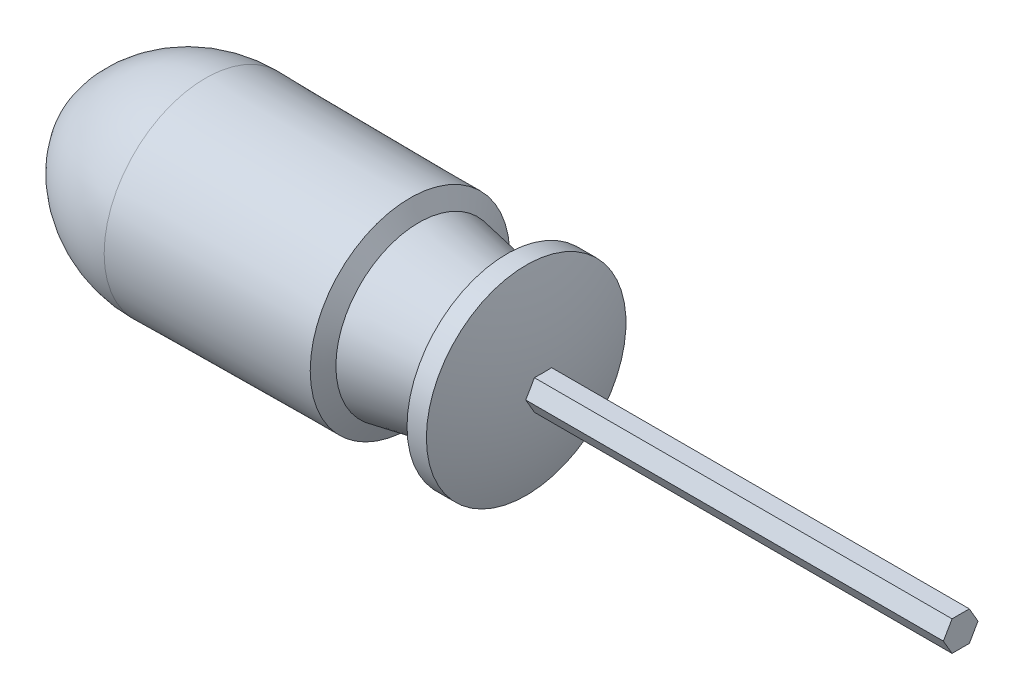
ISO-10303-21;
HEADER;
FILE_DESCRIPTION(('STEP AP214'),'2;1');
FILE_NAME('part.step','',(''),(''),'','','');
FILE_SCHEMA(('AUTOMOTIVE_DESIGN { 1 0 10303 214 1 1 1 1 }'));
ENDSEC;
DATA;
#1=APPLICATION_CONTEXT('core data for automotive mechanical design processes');
#2=APPLICATION_PROTOCOL_DEFINITION('international standard','automotive_design',2000,#1);
#3=PRODUCT_CONTEXT('',#1,'mechanical');
#4=PRODUCT('Part','Part','',(#3));
#5=PRODUCT_RELATED_PRODUCT_CATEGORY('part','',(#4));
#6=PRODUCT_DEFINITION_FORMATION('','',#4);
#7=PRODUCT_DEFINITION_CONTEXT('part definition',#1,'design');
#8=PRODUCT_DEFINITION('design','',#6,#7);
#9=PRODUCT_DEFINITION_SHAPE('','',#8);
#10=(LENGTH_UNIT() NAMED_UNIT(*) SI_UNIT(.MILLI.,.METRE.));
#11=(NAMED_UNIT(*) PLANE_ANGLE_UNIT() SI_UNIT($,.RADIAN.));
#12=(NAMED_UNIT(*) SI_UNIT($,.STERADIAN.) SOLID_ANGLE_UNIT());
#13=UNCERTAINTY_MEASURE_WITH_UNIT(LENGTH_MEASURE(1.E-05),#10,'distance_accuracy_value','');
#14=(GEOMETRIC_REPRESENTATION_CONTEXT(3) GLOBAL_UNCERTAINTY_ASSIGNED_CONTEXT((#13)) GLOBAL_UNIT_ASSIGNED_CONTEXT((#10,
#11,#12)) REPRESENTATION_CONTEXT('',''));
#15=CARTESIAN_POINT('',(0.,0.,0.));
#16=DIRECTION('',(0.,0.,1.));
#17=DIRECTION('',(1.,0.,0.));
#18=AXIS2_PLACEMENT_3D('',#15,#16,#17);
#19=CARTESIAN_POINT('',(-24.682464408379,0.,0.));
#20=DIRECTION('',(-1.,0.,0.));
#21=DIRECTION('',(0.,1.,0.));
#22=AXIS2_PLACEMENT_3D('',#19,#20,#21);
#23=SPHERICAL_SURFACE('',#22,64.1850623551619);
#24=CARTESIAN_POINT('',(35.7416775098517,0.,0.));
#25=DIRECTION('',(-1.,0.,0.));
#26=DIRECTION('',(0.,0.,1.));
#27=AXIS2_PLACEMENT_3D('',#24,#25,#26);
#28=CIRCLE('',#27,21.6482170855138);
#29=CARTESIAN_POINT('',(35.7416775098517,0.,21.6482170855138));
#30=VERTEX_POINT('',#29);
#31=EDGE_CURVE('E108',#30,#30,#28,.T.);
#32=ORIENTED_EDGE('',*,*,#31,.F.);
#33=EDGE_LOOP('',(#32));
#34=FACE_BOUND('',#33,.T.);
#35=CARTESIAN_POINT('',(-24.682464408379,-1.625,-2.81458256229942));
#36=DIRECTION('',(0.,0.5,0.866025403784438));
#37=DIRECTION('',(0.,-0.866025403784439,0.5));
#38=AXIS2_PLACEMENT_3D('',#35,#36,#37);
#39=CIRCLE('',#38,64.1027279414537);
#40=CARTESIAN_POINT('',(39.3927952181156,-3.25,-1.87638837486628));
#41=VERTEX_POINT('',#40);
#42=CARTESIAN_POINT('',(39.3927952181156,0.,-3.75277674973256));
#43=VERTEX_POINT('',#42);
#44=EDGE_CURVE('E11',#41,#43,#39,.T.);
#45=ORIENTED_EDGE('',*,*,#44,.F.);
#46=CARTESIAN_POINT('',(-24.682464408379,-3.25,0.));
#47=DIRECTION('',(0.,1.,0.));
#48=DIRECTION('',(0.,0.,1.));
#49=AXIS2_PLACEMENT_3D('',#46,#47,#48);
#50=CIRCLE('',#49,64.1027279414537);
#51=CARTESIAN_POINT('',(39.3927952181156,-3.25,1.87638837486629));
#52=VERTEX_POINT('',#51);
#53=EDGE_CURVE('E134',#52,#41,#50,.T.);
#54=ORIENTED_EDGE('',*,*,#53,.F.);
#55=CARTESIAN_POINT('',(-24.682464408379,-1.625,2.81458256229943));
#56=DIRECTION('',(0.,0.5,-0.866025403784439));
#57=DIRECTION('',(0.,0.866025403784439,0.5));
#58=AXIS2_PLACEMENT_3D('',#55,#56,#57);
#59=CIRCLE('',#58,64.1027279414537);
#60=CARTESIAN_POINT('',(39.3927952181156,0.,3.75277674973257));
#61=VERTEX_POINT('',#60);
#62=EDGE_CURVE('E137',#61,#52,#59,.T.);
#63=ORIENTED_EDGE('',*,*,#62,.F.);
#64=CARTESIAN_POINT('',(-24.682464408379,1.625,2.81458256229942));
#65=DIRECTION('',(0.,-0.5,-0.866025403784438));
#66=DIRECTION('',(0.,0.866025403784438,-0.5));
#67=AXIS2_PLACEMENT_3D('',#64,#65,#66);
#68=CIRCLE('',#67,64.1027279414537);
#69=CARTESIAN_POINT('',(39.3927952181156,3.25,1.87638837486628));
#70=VERTEX_POINT('',#69);
#71=EDGE_CURVE('E140',#70,#61,#68,.T.);
#72=ORIENTED_EDGE('',*,*,#71,.F.);
#73=CARTESIAN_POINT('',(-24.682464408379,3.25,0.));
#74=DIRECTION('',(0.,-1.,0.));
#75=DIRECTION('',(0.,0.,-1.));
#76=AXIS2_PLACEMENT_3D('',#73,#74,#75);
#77=CIRCLE('',#76,64.1027279414537);
#78=CARTESIAN_POINT('',(39.3927952181156,3.25,-1.87638837486628));
#79=VERTEX_POINT('',#78);
#80=EDGE_CURVE('E53',#79,#70,#77,.T.);
#81=ORIENTED_EDGE('',*,*,#80,.F.);
#82=CARTESIAN_POINT('',(-24.682464408379,1.625,-2.81458256229942));
#83=DIRECTION('',(0.,-0.5,0.866025403784439));
#84=DIRECTION('',(0.,-0.866025403784439,-0.5));
#85=AXIS2_PLACEMENT_3D('',#82,#83,#84);
#86=CIRCLE('',#85,64.1027279414537);
#87=EDGE_CURVE('E43',#43,#79,#86,.T.);
#88=ORIENTED_EDGE('',*,*,#87,.F.);
#89=EDGE_LOOP('',(#45,#54,#63,#72,#81,#88));
#90=FACE_BOUND('',#89,.T.);
#91=ADVANCED_FACE('F35',(#34,#90),#23,.T.);
#92=CARTESIAN_POINT('',(-90.0820529367058,0.,0.));
#93=DIRECTION('',(-1.,0.,0.));
#94=DIRECTION('',(0.,0.,1.));
#95=AXIS2_PLACEMENT_3D('',#92,#93,#94);
#96=CYLINDRICAL_SURFACE('',#95,21.6482170855138);
#97=CARTESIAN_POINT('',(31.5416775098517,0.,0.));
#98=DIRECTION('',(-1.,0.,0.));
#99=DIRECTION('',(0.,0.,1.));
#100=AXIS2_PLACEMENT_3D('',#97,#98,#99);
#101=CIRCLE('',#100,21.6482170855138);
#102=CARTESIAN_POINT('',(31.5416775098517,0.,21.6482170855138));
#103=VERTEX_POINT('',#102);
#104=EDGE_CURVE('E131',#103,#103,#101,.T.);
#105=ORIENTED_EDGE('',*,*,#104,.F.);
#106=EDGE_LOOP('',(#105));
#107=FACE_BOUND('',#106,.T.);
#108=ORIENTED_EDGE('',*,*,#31,.T.);
#109=EDGE_LOOP('',(#108));
#110=FACE_BOUND('',#109,.T.);
#111=ADVANCED_FACE('F37',(#107,#110),#96,.T.);
#112=CARTESIAN_POINT('',(17.3280453235944,0.,0.));
#113=DIRECTION('',(-1.,0.,0.));
#114=DIRECTION('',(0.,0.,1.));
#115=AXIS2_PLACEMENT_3D('',#112,#113,#114);
#116=TOROIDAL_SURFACE('',#115,21.6482170855138,14.2136321862573);
#117=CARTESIAN_POINT('',(29.7831351536954,0.,0.));
#118=DIRECTION('',(-1.,0.,0.));
#119=DIRECTION('',(0.,0.,1.));
#120=AXIS2_PLACEMENT_3D('',#117,#118,#119);
#121=CIRCLE('',#120,14.8);
#122=CARTESIAN_POINT('',(29.7831351536954,0.,14.8));
#123=VERTEX_POINT('',#122);
#124=EDGE_CURVE('E128',#123,#123,#121,.T.);
#125=ORIENTED_EDGE('',*,*,#124,.F.);
#126=EDGE_LOOP('',(#125));
#127=FACE_BOUND('',#126,.T.);
#128=ORIENTED_EDGE('',*,*,#104,.T.);
#129=EDGE_LOOP('',(#128));
#130=FACE_BOUND('',#129,.T.);
#131=ADVANCED_FACE('F177',(#127,#130),#116,.F.);
#132=CARTESIAN_POINT('',(29.7831351536954,0.,0.));
#133=DIRECTION('',(-1.,0.,0.));
#134=DIRECTION('',(0.,0.,1.));
#135=AXIS2_PLACEMENT_3D('',#132,#133,#134);
#136=CONICAL_SURFACE('',#135,14.8,0.182701239732058);
#137=CARTESIAN_POINT('',(12.4635183837141,0.,0.));
#138=DIRECTION('',(-1.,0.,0.));
#139=DIRECTION('',(0.,0.,1.));
#140=AXIS2_PLACEMENT_3D('',#137,#138,#139);
#141=CIRCLE('',#140,18.);
#142=CARTESIAN_POINT('',(12.4635183837141,0.,18.));
#143=VERTEX_POINT('',#142);
#144=EDGE_CURVE('E125',#143,#143,#141,.T.);
#145=ORIENTED_EDGE('',*,*,#144,.F.);
#146=EDGE_LOOP('',(#145));
#147=FACE_BOUND('',#146,.T.);
#148=ORIENTED_EDGE('',*,*,#124,.T.);
#149=EDGE_LOOP('',(#148));
#150=FACE_BOUND('',#149,.T.);
#151=ADVANCED_FACE('F198',(#147,#150),#136,.T.);
#152=CARTESIAN_POINT('',(12.4635183837141,0.,0.));
#153=DIRECTION('',(-1.,0.,0.));
#154=DIRECTION('',(0.,0.,1.));
#155=AXIS2_PLACEMENT_3D('',#152,#153,#154);
#156=CONICAL_SURFACE('',#155,18.,1.08594785594218);
#157=CARTESIAN_POINT('',(10.5416775098517,0.,0.));
#158=DIRECTION('',(-1.,0.,0.));
#159=DIRECTION('',(0.,0.,1.));
#160=AXIS2_PLACEMENT_3D('',#157,#158,#159);
#161=CIRCLE('',#160,21.6482170855138);
#162=CARTESIAN_POINT('',(10.5416775098517,0.,21.6482170855138));
#163=VERTEX_POINT('',#162);
#164=EDGE_CURVE('E122',#163,#163,#161,.T.);
#165=ORIENTED_EDGE('',*,*,#164,.F.);
#166=EDGE_LOOP('',(#165));
#167=FACE_BOUND('',#166,.T.);
#168=ORIENTED_EDGE('',*,*,#144,.T.);
#169=EDGE_LOOP('',(#168));
#170=FACE_BOUND('',#169,.T.);
#171=ADVANCED_FACE('F194',(#167,#170),#156,.T.);
#172=CARTESIAN_POINT('',(10.5416775098517,0.,0.));
#173=DIRECTION('',(-1.,0.,0.));
#174=DIRECTION('',(0.,0.,1.));
#175=AXIS2_PLACEMENT_3D('',#172,#173,#174);
#176=CONICAL_SURFACE('',#175,21.6482170855138,0.00781974888541884);
#177=CARTESIAN_POINT('',(-33.8107653888839,0.,0.));
#178=DIRECTION('',(-1.,0.,0.));
#179=DIRECTION('',(0.,0.,1.));
#180=AXIS2_PLACEMENT_3D('',#177,#178,#179);
#181=CIRCLE('',#180,21.9950491208821);
#182=CARTESIAN_POINT('',(-33.8107653888839,0.,21.9950491208821));
#183=VERTEX_POINT('',#182);
#184=EDGE_CURVE('E119',#183,#183,#181,.T.);
#185=ORIENTED_EDGE('',*,*,#184,.F.);
#186=EDGE_LOOP('',(#185));
#187=FACE_BOUND('',#186,.T.);
#188=ORIENTED_EDGE('',*,*,#164,.T.);
#189=EDGE_LOOP('',(#188));
#190=FACE_BOUND('',#189,.T.);
#191=ADVANCED_FACE('F190',(#187,#190),#176,.T.);
#192=CARTESIAN_POINT('',(-34.0453554646252,0.,0.));
#193=DIRECTION('',(-1.,0.,0.));
#194=DIRECTION('',(0.,0.,1.));
#195=AXIS2_PLACEMENT_3D('',#192,#193,#194);
#196=DEGENERATE_TOROIDAL_SURFACE('',#195,8.0040336567024,30.,.F.);
#197=CARTESIAN_POINT('',(-60.198593388077,0.,0.));
#198=DIRECTION('',(-1.,0.,0.));
#199=DIRECTION('',(0.,0.,1.));
#200=AXIS2_PLACEMENT_3D('',#197,#198,#199);
#201=CIRCLE('',#200,6.69318193399106);
#202=CARTESIAN_POINT('',(-60.198593388077,0.,6.69318193399106));
#203=VERTEX_POINT('',#202);
#204=EDGE_CURVE('E111',#203,#203,#201,.T.);
#205=ORIENTED_EDGE('',*,*,#204,.F.);
#206=EDGE_LOOP('',(#205));
#207=FACE_BOUND('',#206,.T.);
#208=ORIENTED_EDGE('',*,*,#184,.T.);
#209=EDGE_LOOP('',(#208));
#210=FACE_BOUND('',#209,.T.);
#211=ADVANCED_FACE('F186',(#207,#210),#196,.F.);
#212=CARTESIAN_POINT('',(-53.7166286988245,0.,3.0505418613528));
#213=DIRECTION('',(0.,-1.,0.));
#214=DIRECTION('',(0.,0.,1.));
#215=AXIS2_PLACEMENT_3D('',#212,#213,#214);
#216=CIRCLE('',#215,7.43536770654329);
#217=TRIMMED_CURVE('',#216,(PARAMETER_VALUE(-1.99355138171652)),
(PARAMETER_VALUE(1.99355138171652)),.T.,.PARAMETER.);
#218=CARTESIAN_POINT('',(-53.7166286988245,0.,0.));
#219=DIRECTION('',(-1.,0.,0.));
#220=AXIS1_PLACEMENT('',#218,#219);
#221=SURFACE_OF_REVOLUTION('',#217,#220);
#222=CARTESIAN_POINT('',(-60.4974020532171,0.,0.));
#223=VERTEX_POINT('',#222);
#224=VERTEX_LOOP('',#223);
#225=FACE_BOUND('',#224,.T.);
#226=ORIENTED_EDGE('',*,*,#204,.T.);
#227=EDGE_LOOP('',(#226));
#228=FACE_BOUND('',#227,.T.);
#229=ADVANCED_FACE('F183',(#225,#228),#221,.T.);
#230=CARTESIAN_POINT('',(130.,-3.25,-1.87638837486628));
#231=DIRECTION('',(0.,0.5,0.866025403784438));
#232=DIRECTION('',(0.,-0.866025403784439,0.5));
#233=AXIS2_PLACEMENT_3D('',#230,#231,#232);
#234=PLANE('',#233);
#235=DIRECTION('',(-1.,0.,0.));
#236=VECTOR('',#235,1.);
#237=CARTESIAN_POINT('',(130.,-3.25,-1.87638837486628));
#238=LINE('',#237,#236);
#239=CARTESIAN_POINT('',(130.,-3.25,-1.87638837486628));
#240=VERTEX_POINT('',#239);
#241=EDGE_CURVE('E155',#240,#41,#238,.T.);
#242=ORIENTED_EDGE('',*,*,#241,.T.);
#243=ORIENTED_EDGE('',*,*,#44,.T.);
#244=DIRECTION('',(-1.,0.,0.));
#245=VECTOR('',#244,1.);
#246=CARTESIAN_POINT('',(130.,0.,-3.75277674973257));
#247=LINE('',#246,#245);
#248=CARTESIAN_POINT('',(130.,0.,-3.75277674973257));
#249=VERTEX_POINT('',#248);
#250=EDGE_CURVE('E91',#249,#43,#247,.T.);
#251=ORIENTED_EDGE('',*,*,#250,.F.);
#252=DIRECTION('',(0.,0.866025403784438,-0.5));
#253=VECTOR('',#252,1.);
#254=CARTESIAN_POINT('',(130.,-3.25,-1.87638837486628));
#255=LINE('',#254,#253);
#256=EDGE_CURVE('E97',#240,#249,#255,.T.);
#257=ORIENTED_EDGE('',*,*,#256,.F.);
#258=EDGE_LOOP('',(#242,#243,#251,#257));
#259=FACE_BOUND('',#258,.T.);
#260=ADVANCED_FACE('F107',(#259),#234,.F.);
#261=CARTESIAN_POINT('',(130.,0.,-3.75277674973257));
#262=DIRECTION('',(0.,-0.5,0.866025403784439));
#263=DIRECTION('',(0.,-0.866025403784439,-0.5));
#264=AXIS2_PLACEMENT_3D('',#261,#262,#263);
#265=PLANE('',#264);
#266=ORIENTED_EDGE('',*,*,#250,.T.);
#267=ORIENTED_EDGE('',*,*,#87,.T.);
#268=DIRECTION('',(-1.,0.,0.));
#269=VECTOR('',#268,1.);
#270=CARTESIAN_POINT('',(130.,3.25,-1.87638837486628));
#271=LINE('',#270,#269);
#272=CARTESIAN_POINT('',(130.,3.25,-1.87638837486628));
#273=VERTEX_POINT('',#272);
#274=EDGE_CURVE('E93',#273,#79,#271,.T.);
#275=ORIENTED_EDGE('',*,*,#274,.F.);
#276=DIRECTION('',(0.,0.866025403784439,0.5));
#277=VECTOR('',#276,1.);
#278=CARTESIAN_POINT('',(130.,0.,-3.75277674973257));
#279=LINE('',#278,#277);
#280=EDGE_CURVE('E87',#249,#273,#279,.T.);
#281=ORIENTED_EDGE('',*,*,#280,.F.);
#282=EDGE_LOOP('',(#266,#267,#275,#281));
#283=FACE_BOUND('',#282,.T.);
#284=ADVANCED_FACE('F89',(#283),#265,.F.);
#285=CARTESIAN_POINT('',(130.,3.25,-1.87638837486628));
#286=DIRECTION('',(0.,-1.,0.));
#287=DIRECTION('',(0.,0.,-1.));
#288=AXIS2_PLACEMENT_3D('',#285,#286,#287);
#289=PLANE('',#288);
#290=ORIENTED_EDGE('',*,*,#274,.T.);
#291=ORIENTED_EDGE('',*,*,#80,.T.);
#292=DIRECTION('',(-1.,0.,0.));
#293=VECTOR('',#292,1.);
#294=CARTESIAN_POINT('',(130.,3.25,1.87638837486628));
#295=LINE('',#294,#293);
#296=CARTESIAN_POINT('',(130.,3.25,1.87638837486628));
#297=VERTEX_POINT('',#296);
#298=EDGE_CURVE('E113',#297,#70,#295,.T.);
#299=ORIENTED_EDGE('',*,*,#298,.F.);
#300=DIRECTION('',(0.,0.,1.));
#301=VECTOR('',#300,1.);
#302=CARTESIAN_POINT('',(130.,3.25,-1.87638837486628));
#303=LINE('',#302,#301);
#304=EDGE_CURVE('E96',#273,#297,#303,.T.);
#305=ORIENTED_EDGE('',*,*,#304,.F.);
#306=EDGE_LOOP('',(#290,#291,#299,#305));
#307=FACE_BOUND('',#306,.T.);
#308=ADVANCED_FACE('F144',(#307),#289,.F.);
#309=CARTESIAN_POINT('',(130.,3.25,1.87638837486628));
#310=DIRECTION('',(0.,-0.5,-0.866025403784438));
#311=DIRECTION('',(0.,0.866025403784438,-0.5));
#312=AXIS2_PLACEMENT_3D('',#309,#310,#311);
#313=PLANE('',#312);
#314=ORIENTED_EDGE('',*,*,#298,.T.);
#315=ORIENTED_EDGE('',*,*,#71,.T.);
#316=DIRECTION('',(-1.,0.,0.));
#317=VECTOR('',#316,1.);
#318=CARTESIAN_POINT('',(130.,0.,3.75277674973257));
#319=LINE('',#318,#317);
#320=CARTESIAN_POINT('',(130.,0.,3.75277674973257));
#321=VERTEX_POINT('',#320);
#322=EDGE_CURVE('E160',#321,#61,#319,.T.);
#323=ORIENTED_EDGE('',*,*,#322,.F.);
#324=DIRECTION('',(0.,-0.866025403784438,0.5));
#325=VECTOR('',#324,1.);
#326=CARTESIAN_POINT('',(130.,3.25,1.87638837486628));
#327=LINE('',#326,#325);
#328=EDGE_CURVE('E148',#297,#321,#327,.T.);
#329=ORIENTED_EDGE('',*,*,#328,.F.);
#330=EDGE_LOOP('',(#314,#315,#323,#329));
#331=FACE_BOUND('',#330,.T.);
#332=ADVANCED_FACE('F163',(#331),#313,.F.);
#333=CARTESIAN_POINT('',(130.,0.,3.75277674973257));
#334=DIRECTION('',(0.,0.5,-0.866025403784439));
#335=DIRECTION('',(0.,0.866025403784439,0.5));
#336=AXIS2_PLACEMENT_3D('',#333,#334,#335);
#337=PLANE('',#336);
#338=ORIENTED_EDGE('',*,*,#322,.T.);
#339=ORIENTED_EDGE('',*,*,#62,.T.);
#340=DIRECTION('',(-1.,0.,0.));
#341=VECTOR('',#340,1.);
#342=CARTESIAN_POINT('',(130.,-3.25,1.87638837486629));
#343=LINE('',#342,#341);
#344=CARTESIAN_POINT('',(130.,-3.25,1.87638837486629));
#345=VERTEX_POINT('',#344);
#346=EDGE_CURVE('E157',#345,#52,#343,.T.);
#347=ORIENTED_EDGE('',*,*,#346,.F.);
#348=DIRECTION('',(0.,-0.866025403784439,-0.5));
#349=VECTOR('',#348,1.);
#350=CARTESIAN_POINT('',(130.,0.,3.75277674973257));
#351=LINE('',#350,#349);
#352=EDGE_CURVE('E150',#321,#345,#351,.T.);
#353=ORIENTED_EDGE('',*,*,#352,.F.);
#354=EDGE_LOOP('',(#338,#339,#347,#353));
#355=FACE_BOUND('',#354,.T.);
#356=ADVANCED_FACE('F168',(#355),#337,.F.);
#357=CARTESIAN_POINT('',(130.,-3.25,1.87638837486629));
#358=DIRECTION('',(0.,1.,0.));
#359=DIRECTION('',(0.,0.,1.));
#360=AXIS2_PLACEMENT_3D('',#357,#358,#359);
#361=PLANE('',#360);
#362=ORIENTED_EDGE('',*,*,#346,.T.);
#363=ORIENTED_EDGE('',*,*,#53,.T.);
#364=ORIENTED_EDGE('',*,*,#241,.F.);
#365=DIRECTION('',(0.,0.,-1.));
#366=VECTOR('',#365,1.);
#367=CARTESIAN_POINT('',(130.,-3.25,1.87638837486629));
#368=LINE('',#367,#366);
#369=EDGE_CURVE('E102',#345,#240,#368,.T.);
#370=ORIENTED_EDGE('',*,*,#369,.F.);
#371=EDGE_LOOP('',(#362,#363,#364,#370));
#372=FACE_BOUND('',#371,.T.);
#373=ADVANCED_FACE('F170',(#372),#361,.F.);
#374=CARTESIAN_POINT('',(130.,0.,0.));
#375=DIRECTION('',(1.,0.,0.));
#376=DIRECTION('',(0.,0.,-1.));
#377=AXIS2_PLACEMENT_3D('',#374,#375,#376);
#378=PLANE('',#377);
#379=ORIENTED_EDGE('',*,*,#256,.T.);
#380=ORIENTED_EDGE('',*,*,#280,.T.);
#381=ORIENTED_EDGE('',*,*,#304,.T.);
#382=ORIENTED_EDGE('',*,*,#328,.T.);
#383=ORIENTED_EDGE('',*,*,#352,.T.);
#384=ORIENTED_EDGE('',*,*,#369,.T.);
#385=EDGE_LOOP('',(#379,#380,#381,#382,#383,#384));
#386=FACE_BOUND('',#385,.T.);
#387=ADVANCED_FACE('F100',(#386),#378,.T.);
#388=CLOSED_SHELL('',(#91,#111,#131,#151,#171,#191,#211,#229,#260,#284,#308,#332,#356,#373,#387));
#389=MANIFOLD_SOLID_BREP('B2',#388);
#390=ADVANCED_BREP_SHAPE_REPRESENTATION('',(#18,#389),#14);
#391=SHAPE_DEFINITION_REPRESENTATION(#9,#390);
ENDSEC;
END-ISO-10303-21;
